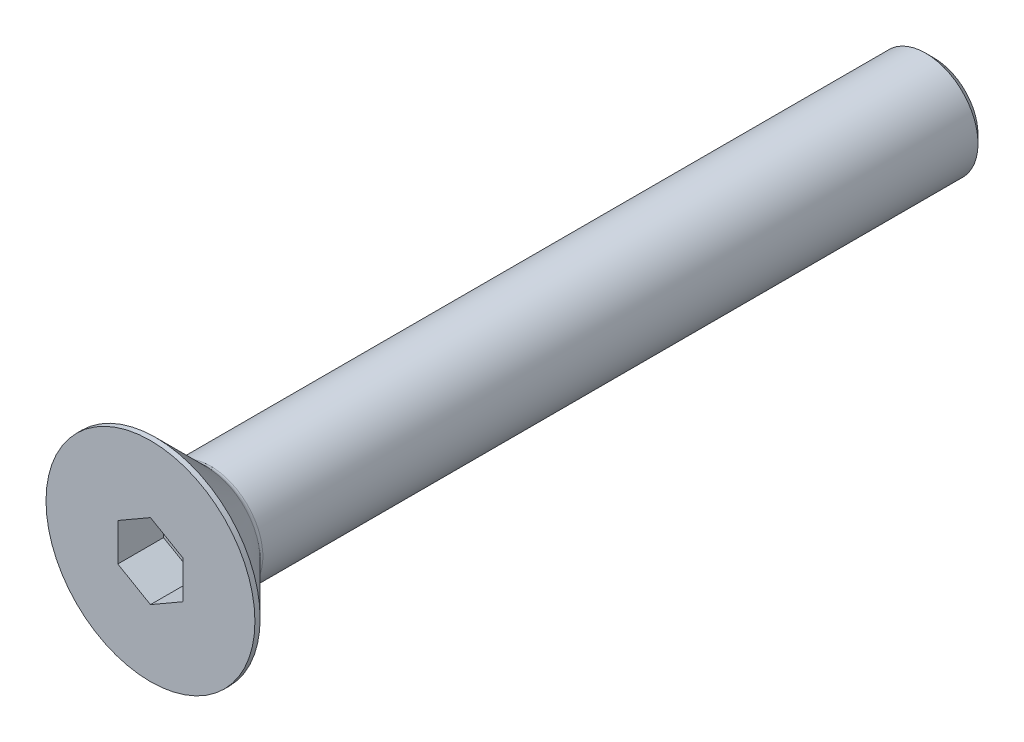
ISO-10303-21;
HEADER;
FILE_DESCRIPTION(('STEP AP214'),'2;1');
FILE_NAME('part.step','',(''),(''),'','','');
FILE_SCHEMA(('AUTOMOTIVE_DESIGN { 1 0 10303 214 1 1 1 1 }'));
ENDSEC;
DATA;
#1=APPLICATION_CONTEXT('core data for automotive mechanical design processes');
#2=APPLICATION_PROTOCOL_DEFINITION('international standard','automotive_design',2000,#1);
#3=PRODUCT_CONTEXT('',#1,'mechanical');
#4=PRODUCT('Part','Part','',(#3));
#5=PRODUCT_RELATED_PRODUCT_CATEGORY('part','',(#4));
#6=PRODUCT_DEFINITION_FORMATION('','',#4);
#7=PRODUCT_DEFINITION_CONTEXT('part definition',#1,'design');
#8=PRODUCT_DEFINITION('design','',#6,#7);
#9=PRODUCT_DEFINITION_SHAPE('','',#8);
#10=(LENGTH_UNIT() NAMED_UNIT(*) SI_UNIT(.MILLI.,.METRE.));
#11=(NAMED_UNIT(*) PLANE_ANGLE_UNIT() SI_UNIT($,.RADIAN.));
#12=(NAMED_UNIT(*) SI_UNIT($,.STERADIAN.) SOLID_ANGLE_UNIT());
#13=UNCERTAINTY_MEASURE_WITH_UNIT(LENGTH_MEASURE(1.E-05),#10,'distance_accuracy_value','');
#14=(GEOMETRIC_REPRESENTATION_CONTEXT(3) GLOBAL_UNCERTAINTY_ASSIGNED_CONTEXT((#13)) GLOBAL_UNIT_ASSIGNED_CONTEXT((#10,
#11,#12)) REPRESENTATION_CONTEXT('',''));
#15=CARTESIAN_POINT('',(0.,0.,0.));
#16=DIRECTION('',(0.,0.,1.));
#17=DIRECTION('',(1.,0.,0.));
#18=AXIS2_PLACEMENT_3D('',#15,#16,#17);
#19=CARTESIAN_POINT('',(0.,0.,-3.5));
#20=DIRECTION('',(0.,0.,1.));
#21=DIRECTION('',(1.,0.,0.));
#22=AXIS2_PLACEMENT_3D('',#19,#20,#21);
#23=PLANE('',#22);
#24=DIRECTION('',(-0.866025403784439,-0.5,0.));
#25=VECTOR('',#24,1.);
#26=CARTESIAN_POINT('',(0.,2.88675134594813,-3.5));
#27=LINE('',#26,#25);
#28=CARTESIAN_POINT('',(0.,2.88675134594813,-3.5));
#29=VERTEX_POINT('',#28);
#30=CARTESIAN_POINT('',(-2.5,1.44337567297406,-3.5));
#31=VERTEX_POINT('',#30);
#32=EDGE_CURVE('E82',#29,#31,#27,.T.);
#33=ORIENTED_EDGE('',*,*,#32,.T.);
#34=DIRECTION('',(0.,1.,0.));
#35=VECTOR('',#34,1.);
#36=CARTESIAN_POINT('',(-2.5,1.44337567297406,-3.5));
#37=LINE('',#36,#35);
#38=CARTESIAN_POINT('',(-2.5,-1.44337567297407,-3.5));
#39=VERTEX_POINT('',#38);
#40=EDGE_CURVE('E66',#31,#39,#37,.F.);
#41=ORIENTED_EDGE('',*,*,#40,.T.);
#42=DIRECTION('',(0.866025403784439,-0.499999999999999,0.));
#43=VECTOR('',#42,1.);
#44=CARTESIAN_POINT('',(-2.5,-1.44337567297407,-3.5));
#45=LINE('',#44,#43);
#46=CARTESIAN_POINT('',(0.,-2.88675134594813,-3.5));
#47=VERTEX_POINT('',#46);
#48=EDGE_CURVE('E71',#39,#47,#45,.T.);
#49=ORIENTED_EDGE('',*,*,#48,.T.);
#50=DIRECTION('',(0.866025403784439,0.5,0.));
#51=VECTOR('',#50,1.);
#52=CARTESIAN_POINT('',(0.,-2.88675134594813,-3.5));
#53=LINE('',#52,#51);
#54=CARTESIAN_POINT('',(2.5,-1.44337567297406,-3.5));
#55=VERTEX_POINT('',#54);
#56=EDGE_CURVE('E128',#47,#55,#53,.T.);
#57=ORIENTED_EDGE('',*,*,#56,.T.);
#58=DIRECTION('',(0.,1.,0.));
#59=VECTOR('',#58,1.);
#60=CARTESIAN_POINT('',(2.5,-1.44337567297406,-3.5));
#61=LINE('',#60,#59);
#62=CARTESIAN_POINT('',(2.5,1.44337567297407,-3.5));
#63=VERTEX_POINT('',#62);
#64=EDGE_CURVE('E132',#55,#63,#61,.T.);
#65=ORIENTED_EDGE('',*,*,#64,.T.);
#66=DIRECTION('',(-0.866025403784439,0.499999999999999,0.));
#67=VECTOR('',#66,1.);
#68=CARTESIAN_POINT('',(2.5,1.44337567297407,-3.5));
#69=LINE('',#68,#67);
#70=EDGE_CURVE('E137',#63,#29,#69,.T.);
#71=ORIENTED_EDGE('',*,*,#70,.T.);
#72=EDGE_LOOP('',(#33,#41,#49,#57,#65,#71));
#73=FACE_BOUND('',#72,.T.);
#74=ADVANCED_FACE('F15',(#73),#23,.T.);
#75=CARTESIAN_POINT('',(-2.5,-1.44337567297407,0.));
#76=DIRECTION('',(-0.499999999999999,-0.866025403784439,0.));
#77=DIRECTION('',(0.866025403784439,-0.499999999999999,0.));
#78=AXIS2_PLACEMENT_3D('',#75,#76,#77);
#79=PLANE('',#78);
#80=DIRECTION('',(0.,0.,1.));
#81=VECTOR('',#80,1.);
#82=CARTESIAN_POINT('',(-2.5,-1.44337567297407,0.));
#83=LINE('',#82,#81);
#84=CARTESIAN_POINT('',(-2.5,-1.44337567297407,0.));
#85=VERTEX_POINT('',#84);
#86=EDGE_CURVE('E73',#39,#85,#83,.T.);
#87=ORIENTED_EDGE('',*,*,#86,.T.);
#88=DIRECTION('',(-0.866025403784439,0.499999999999999,0.));
#89=VECTOR('',#88,1.);
#90=CARTESIAN_POINT('',(0.,-2.88675134594813,0.));
#91=LINE('',#90,#89);
#92=CARTESIAN_POINT('',(0.,-2.88675134594813,0.));
#93=VERTEX_POINT('',#92);
#94=EDGE_CURVE('E126',#93,#85,#91,.T.);
#95=ORIENTED_EDGE('',*,*,#94,.F.);
#96=DIRECTION('',(0.,0.,1.));
#97=VECTOR('',#96,1.);
#98=CARTESIAN_POINT('',(0.,-2.88675134594813,0.));
#99=LINE('',#98,#97);
#100=EDGE_CURVE('E76',#93,#47,#99,.F.);
#101=ORIENTED_EDGE('',*,*,#100,.T.);
#102=ORIENTED_EDGE('',*,*,#48,.F.);
#103=EDGE_LOOP('',(#87,#95,#101,#102));
#104=FACE_BOUND('',#103,.T.);
#105=ADVANCED_FACE('F72',(#104),#79,.F.);
#106=CARTESIAN_POINT('',(-2.5,1.44337567297406,0.));
#107=DIRECTION('',(-1.,0.,0.));
#108=DIRECTION('',(0.,0.,1.));
#109=AXIS2_PLACEMENT_3D('',#106,#107,#108);
#110=PLANE('',#109);
#111=DIRECTION('',(0.,0.,1.));
#112=VECTOR('',#111,1.);
#113=CARTESIAN_POINT('',(-2.5,1.44337567297406,0.));
#114=LINE('',#113,#112);
#115=CARTESIAN_POINT('',(-2.5,1.44337567297406,0.));
#116=VERTEX_POINT('',#115);
#117=EDGE_CURVE('E84',#31,#116,#114,.T.);
#118=ORIENTED_EDGE('',*,*,#117,.T.);
#119=DIRECTION('',(0.,1.,0.));
#120=VECTOR('',#119,1.);
#121=CARTESIAN_POINT('',(-2.5,0.,0.));
#122=LINE('',#121,#120);
#123=EDGE_CURVE('E88',#85,#116,#122,.T.);
#124=ORIENTED_EDGE('',*,*,#123,.F.);
#125=ORIENTED_EDGE('',*,*,#86,.F.);
#126=ORIENTED_EDGE('',*,*,#40,.F.);
#127=EDGE_LOOP('',(#118,#124,#125,#126));
#128=FACE_BOUND('',#127,.T.);
#129=ADVANCED_FACE('F86',(#128),#110,.F.);
#130=CARTESIAN_POINT('',(0.,2.88675134594813,0.));
#131=DIRECTION('',(-0.5,0.866025403784439,0.));
#132=DIRECTION('',(-0.866025403784439,-0.5,0.));
#133=AXIS2_PLACEMENT_3D('',#130,#131,#132);
#134=PLANE('',#133);
#135=DIRECTION('',(0.,0.,1.));
#136=VECTOR('',#135,1.);
#137=CARTESIAN_POINT('',(0.,2.88675134594813,0.));
#138=LINE('',#137,#136);
#139=CARTESIAN_POINT('',(0.,2.88675134594813,0.));
#140=VERTEX_POINT('',#139);
#141=EDGE_CURVE('E139',#29,#140,#138,.T.);
#142=ORIENTED_EDGE('',*,*,#141,.T.);
#143=DIRECTION('',(0.866025403784439,0.499999999999999,0.));
#144=VECTOR('',#143,1.);
#145=CARTESIAN_POINT('',(-2.5,1.44337567297406,0.));
#146=LINE('',#145,#144);
#147=EDGE_CURVE('E122',#116,#140,#146,.T.);
#148=ORIENTED_EDGE('',*,*,#147,.F.);
#149=ORIENTED_EDGE('',*,*,#117,.F.);
#150=ORIENTED_EDGE('',*,*,#32,.F.);
#151=EDGE_LOOP('',(#142,#148,#149,#150));
#152=FACE_BOUND('',#151,.T.);
#153=ADVANCED_FACE('F143',(#152),#134,.F.);
#154=CARTESIAN_POINT('',(2.5,1.44337567297407,0.));
#155=DIRECTION('',(0.499999999999999,0.866025403784439,0.));
#156=DIRECTION('',(-0.866025403784439,0.499999999999999,0.));
#157=AXIS2_PLACEMENT_3D('',#154,#155,#156);
#158=PLANE('',#157);
#159=DIRECTION('',(0.,0.,-1.));
#160=VECTOR('',#159,1.);
#161=CARTESIAN_POINT('',(2.5,1.44337567297407,0.));
#162=LINE('',#161,#160);
#163=CARTESIAN_POINT('',(2.5,1.44337567297407,0.));
#164=VERTEX_POINT('',#163);
#165=EDGE_CURVE('E135',#63,#164,#162,.F.);
#166=ORIENTED_EDGE('',*,*,#165,.T.);
#167=DIRECTION('',(0.866025403784439,-0.499999999999999,0.));
#168=VECTOR('',#167,1.);
#169=CARTESIAN_POINT('',(0.,2.88675134594813,0.));
#170=LINE('',#169,#168);
#171=EDGE_CURVE('E119',#140,#164,#170,.T.);
#172=ORIENTED_EDGE('',*,*,#171,.F.);
#173=ORIENTED_EDGE('',*,*,#141,.F.);
#174=ORIENTED_EDGE('',*,*,#70,.F.);
#175=EDGE_LOOP('',(#166,#172,#173,#174));
#176=FACE_BOUND('',#175,.T.);
#177=ADVANCED_FACE('F154',(#176),#158,.F.);
#178=CARTESIAN_POINT('',(2.5,-1.44337567297406,0.));
#179=DIRECTION('',(1.,0.,0.));
#180=DIRECTION('',(0.,0.,-1.));
#181=AXIS2_PLACEMENT_3D('',#178,#179,#180);
#182=PLANE('',#181);
#183=DIRECTION('',(0.,0.,1.));
#184=VECTOR('',#183,1.);
#185=CARTESIAN_POINT('',(2.5,-1.44337567297406,0.));
#186=LINE('',#185,#184);
#187=CARTESIAN_POINT('',(2.5,-1.44337567297406,0.));
#188=VERTEX_POINT('',#187);
#189=EDGE_CURVE('E34',#55,#188,#186,.T.);
#190=ORIENTED_EDGE('',*,*,#189,.T.);
#191=DIRECTION('',(0.,1.,0.));
#192=VECTOR('',#191,1.);
#193=CARTESIAN_POINT('',(2.5,0.,0.));
#194=LINE('',#193,#192);
#195=EDGE_CURVE('E116',#164,#188,#194,.F.);
#196=ORIENTED_EDGE('',*,*,#195,.F.);
#197=ORIENTED_EDGE('',*,*,#165,.F.);
#198=ORIENTED_EDGE('',*,*,#64,.F.);
#199=EDGE_LOOP('',(#190,#196,#197,#198));
#200=FACE_BOUND('',#199,.T.);
#201=ADVANCED_FACE('F152',(#200),#182,.F.);
#202=CARTESIAN_POINT('',(0.,-2.88675134594813,0.));
#203=DIRECTION('',(0.5,-0.866025403784439,0.));
#204=DIRECTION('',(0.866025403784439,0.5,0.));
#205=AXIS2_PLACEMENT_3D('',#202,#203,#204);
#206=PLANE('',#205);
#207=ORIENTED_EDGE('',*,*,#100,.F.);
#208=DIRECTION('',(-0.866025403784439,-0.499999999999999,0.));
#209=VECTOR('',#208,1.);
#210=CARTESIAN_POINT('',(2.5,-1.44337567297406,0.));
#211=LINE('',#210,#209);
#212=EDGE_CURVE('E113',#188,#93,#211,.T.);
#213=ORIENTED_EDGE('',*,*,#212,.F.);
#214=ORIENTED_EDGE('',*,*,#189,.F.);
#215=ORIENTED_EDGE('',*,*,#56,.F.);
#216=EDGE_LOOP('',(#207,#213,#214,#215));
#217=FACE_BOUND('',#216,.T.);
#218=ADVANCED_FACE('F150',(#217),#206,.F.);
#219=CARTESIAN_POINT('',(4.,0.,0.));
#220=DIRECTION('',(0.,0.,1.));
#221=DIRECTION('',(1.,0.,0.));
#222=AXIS2_PLACEMENT_3D('',#219,#220,#221);
#223=PLANE('',#222);
#224=ORIENTED_EDGE('',*,*,#195,.T.);
#225=ORIENTED_EDGE('',*,*,#212,.T.);
#226=ORIENTED_EDGE('',*,*,#94,.T.);
#227=ORIENTED_EDGE('',*,*,#123,.T.);
#228=ORIENTED_EDGE('',*,*,#147,.T.);
#229=ORIENTED_EDGE('',*,*,#171,.T.);
#230=EDGE_LOOP('',(#224,#225,#226,#227,#228,#229));
#231=FACE_BOUND('',#230,.T.);
#232=CARTESIAN_POINT('',(0.,0.,0.));
#233=DIRECTION('',(0.,0.,-1.));
#234=DIRECTION('',(-1.,0.,0.));
#235=AXIS2_PLACEMENT_3D('',#232,#233,#234);
#236=CIRCLE('',#235,8.);
#237=CARTESIAN_POINT('',(-8.,0.,0.));
#238=VERTEX_POINT('',#237);
#239=EDGE_CURVE('E19',#238,#238,#236,.T.);
#240=ORIENTED_EDGE('',*,*,#239,.F.);
#241=EDGE_LOOP('',(#240));
#242=FACE_BOUND('',#241,.T.);
#243=ADVANCED_FACE('F147',(#231,#242),#223,.T.);
#244=CARTESIAN_POINT('',(0.,0.,-0.200000000000005));
#245=DIRECTION('',(0.,0.,-1.));
#246=DIRECTION('',(-1.,0.,0.));
#247=AXIS2_PLACEMENT_3D('',#244,#245,#246);
#248=CYLINDRICAL_SURFACE('',#247,8.);
#249=ORIENTED_EDGE('',*,*,#239,.T.);
#250=EDGE_LOOP('',(#249));
#251=FACE_BOUND('',#250,.T.);
#252=CARTESIAN_POINT('',(0.,0.,-0.399999998251133));
#253=DIRECTION('',(0.,0.,1.));
#254=DIRECTION('',(1.,0.,0.));
#255=AXIS2_PLACEMENT_3D('',#252,#253,#254);
#256=CIRCLE('',#255,7.99999999821921);
#257=CARTESIAN_POINT('',(7.99999999821921,0.,-0.399999998251133));
#258=VERTEX_POINT('',#257);
#259=EDGE_CURVE('E100',#258,#258,#256,.F.);
#260=ORIENTED_EDGE('',*,*,#259,.F.);
#261=EDGE_LOOP('',(#260));
#262=FACE_BOUND('',#261,.T.);
#263=ADVANCED_FACE('F183',(#251,#262),#248,.T.);
#264=CARTESIAN_POINT('',(0.,0.,-0.399999998251133));
#265=DIRECTION('',(0.,0.,1.));
#266=DIRECTION('',(1.,0.,0.));
#267=AXIS2_PLACEMENT_3D('',#264,#265,#266);
#268=CONICAL_SURFACE('',#267,7.99999999821921,0.785398162505018);
#269=CARTESIAN_POINT('',(0.,0.,-4.25355339059328));
#270=DIRECTION('',(0.,0.,-1.));
#271=DIRECTION('',(0.,1.,0.));
#272=AXIS2_PLACEMENT_3D('',#269,#270,#271);
#273=CIRCLE('',#272,4.14644660940672);
#274=CARTESIAN_POINT('',(0.,4.14644660940672,-4.25355339059328));
#275=VERTEX_POINT('',#274);
#276=EDGE_CURVE('E94',#275,#275,#273,.T.);
#277=ORIENTED_EDGE('',*,*,#276,.F.);
#278=EDGE_LOOP('',(#277));
#279=FACE_BOUND('',#278,.T.);
#280=ORIENTED_EDGE('',*,*,#259,.T.);
#281=EDGE_LOOP('',(#280));
#282=FACE_BOUND('',#281,.T.);
#283=ADVANCED_FACE('F179',(#279,#282),#268,.T.);
#284=CARTESIAN_POINT('',(2.,0.,-60.));
#285=DIRECTION('',(0.,0.,-1.));
#286=DIRECTION('',(-1.,0.,0.));
#287=AXIS2_PLACEMENT_3D('',#284,#285,#286);
#288=PLANE('',#287);
#289=CARTESIAN_POINT('',(0.,0.,-60.0000000002296));
#290=DIRECTION('',(0.,0.,1.));
#291=DIRECTION('',(1.,0.,0.));
#292=AXIS2_PLACEMENT_3D('',#289,#290,#291);
#293=CIRCLE('',#292,3.37500000028967);
#294=CARTESIAN_POINT('',(3.37500000028967,0.,-60.0000000002296));
#295=VERTEX_POINT('',#294);
#296=EDGE_CURVE('E92',#295,#295,#293,.T.);
#297=ORIENTED_EDGE('',*,*,#296,.F.);
#298=EDGE_LOOP('',(#297));
#299=FACE_BOUND('',#298,.T.);
#300=ADVANCED_FACE('F176',(#299),#288,.T.);
#301=CARTESIAN_POINT('',(0.,0.,-4.60710678118656));
#302=DIRECTION('',(0.,0.,-1.));
#303=DIRECTION('',(-1.,0.,0.));
#304=AXIS2_PLACEMENT_3D('',#301,#302,#303);
#305=TOROIDAL_SURFACE('',#304,4.5,0.5);
#306=CARTESIAN_POINT('',(0.,0.,-4.60710678118656));
#307=DIRECTION('',(0.,0.,-1.));
#308=DIRECTION('',(-1.,0.,0.));
#309=AXIS2_PLACEMENT_3D('',#306,#307,#308);
#310=CIRCLE('',#309,4.);
#311=CARTESIAN_POINT('',(-4.,0.,-4.60710678118656));
#312=VERTEX_POINT('',#311);
#313=EDGE_CURVE('E25',#312,#312,#310,.T.);
#314=ORIENTED_EDGE('',*,*,#313,.F.);
#315=EDGE_LOOP('',(#314));
#316=FACE_BOUND('',#315,.T.);
#317=ORIENTED_EDGE('',*,*,#276,.T.);
#318=EDGE_LOOP('',(#317));
#319=FACE_BOUND('',#318,.T.);
#320=ADVANCED_FACE('F17',(#316,#319),#305,.F.);
#321=CARTESIAN_POINT('',(0.,0.,-59.3749999997044));
#322=DIRECTION('',(0.,0.,1.));
#323=DIRECTION('',(1.,0.,0.));
#324=AXIS2_PLACEMENT_3D('',#321,#322,#323);
#325=CONICAL_SURFACE('',#324,3.99999999973488,0.785398162533428);
#326=ORIENTED_EDGE('',*,*,#296,.T.);
#327=EDGE_LOOP('',(#326));
#328=FACE_BOUND('',#327,.T.);
#329=CARTESIAN_POINT('',(0.,0.,-59.375));
#330=DIRECTION('',(0.,0.,-1.));
#331=DIRECTION('',(-1.,0.,0.));
#332=AXIS2_PLACEMENT_3D('',#329,#330,#331);
#333=CIRCLE('',#332,4.);
#334=CARTESIAN_POINT('',(-4.,0.,-59.375));
#335=VERTEX_POINT('',#334);
#336=EDGE_CURVE('E10',#335,#335,#333,.F.);
#337=ORIENTED_EDGE('',*,*,#336,.F.);
#338=EDGE_LOOP('',(#337));
#339=FACE_BOUND('',#338,.T.);
#340=ADVANCED_FACE('F166',(#328,#339),#325,.T.);
#341=CARTESIAN_POINT('',(0.,0.,-32.2));
#342=DIRECTION('',(0.,0.,-1.));
#343=DIRECTION('',(-1.,0.,0.));
#344=AXIS2_PLACEMENT_3D('',#341,#342,#343);
#345=CYLINDRICAL_SURFACE('',#344,4.);
#346=ORIENTED_EDGE('',*,*,#336,.T.);
#347=EDGE_LOOP('',(#346));
#348=FACE_BOUND('',#347,.T.);
#349=ORIENTED_EDGE('',*,*,#313,.T.);
#350=EDGE_LOOP('',(#349));
#351=FACE_BOUND('',#350,.T.);
#352=ADVANCED_FACE('F164',(#348,#351),#345,.T.);
#353=CLOSED_SHELL('',(#74,#105,#129,#153,#177,#201,#218,#243,#263,#283,#300,#320,#340,#352));
#354=MANIFOLD_SOLID_BREP('B1',#353);
#355=ADVANCED_BREP_SHAPE_REPRESENTATION('',(#18,#354),#14);
#356=SHAPE_DEFINITION_REPRESENTATION(#9,#355);
ENDSEC;
END-ISO-10303-21;
